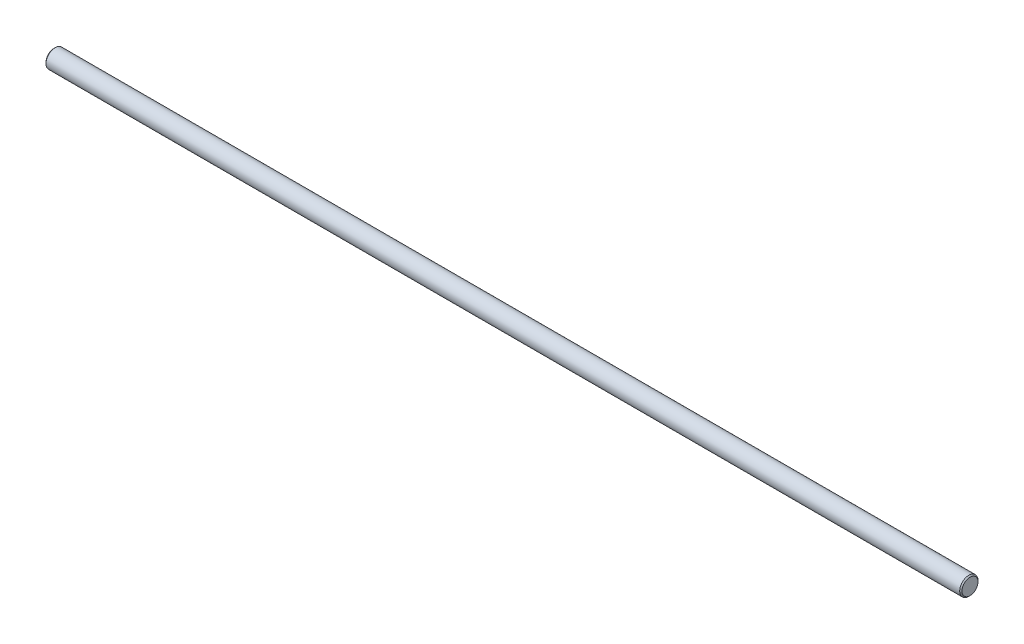
ISO-10303-21;
HEADER;
FILE_DESCRIPTION(('STEP AP214'),'2;1');
FILE_NAME('part.step','',(''),(''),'','','');
FILE_SCHEMA(('AUTOMOTIVE_DESIGN { 1 0 10303 214 1 1 1 1 }'));
ENDSEC;
DATA;
#1=APPLICATION_CONTEXT('core data for automotive mechanical design processes');
#2=APPLICATION_PROTOCOL_DEFINITION('international standard','automotive_design',2000,#1);
#3=PRODUCT_CONTEXT('',#1,'mechanical');
#4=PRODUCT('Part','Part','',(#3));
#5=PRODUCT_RELATED_PRODUCT_CATEGORY('part','',(#4));
#6=PRODUCT_DEFINITION_FORMATION('','',#4);
#7=PRODUCT_DEFINITION_CONTEXT('part definition',#1,'design');
#8=PRODUCT_DEFINITION('design','',#6,#7);
#9=PRODUCT_DEFINITION_SHAPE('','',#8);
#10=(LENGTH_UNIT() NAMED_UNIT(*) SI_UNIT(.MILLI.,.METRE.));
#11=(NAMED_UNIT(*) PLANE_ANGLE_UNIT() SI_UNIT($,.RADIAN.));
#12=(NAMED_UNIT(*) SI_UNIT($,.STERADIAN.) SOLID_ANGLE_UNIT());
#13=UNCERTAINTY_MEASURE_WITH_UNIT(LENGTH_MEASURE(1.E-05),#10,'distance_accuracy_value','');
#14=(GEOMETRIC_REPRESENTATION_CONTEXT(3) GLOBAL_UNCERTAINTY_ASSIGNED_CONTEXT((#13)) GLOBAL_UNIT_ASSIGNED_CONTEXT((#10,
#11,#12)) REPRESENTATION_CONTEXT('',''));
#15=CARTESIAN_POINT('',(0.,0.,0.));
#16=DIRECTION('',(0.,0.,1.));
#17=DIRECTION('',(1.,0.,0.));
#18=AXIS2_PLACEMENT_3D('',#15,#16,#17);
#19=CARTESIAN_POINT('',(400.,0.,0.));
#20=DIRECTION('',(-1.,0.,0.));
#21=DIRECTION('',(0.,0.,1.));
#22=AXIS2_PLACEMENT_3D('',#19,#20,#21);
#23=CYLINDRICAL_SURFACE('',#22,4.);
#24=CARTESIAN_POINT('',(399.5,0.,0.));
#25=DIRECTION('',(1.,0.,0.));
#26=DIRECTION('',(0.,0.,-1.));
#27=AXIS2_PLACEMENT_3D('',#24,#25,#26);
#28=CIRCLE('',#27,4.);
#29=CARTESIAN_POINT('',(399.5,0.,-4.));
#30=VERTEX_POINT('',#29);
#31=EDGE_CURVE('E48',#30,#30,#28,.F.);
#32=ORIENTED_EDGE('',*,*,#31,.T.);
#33=EDGE_LOOP('',(#32));
#34=FACE_BOUND('',#33,.T.);
#35=CARTESIAN_POINT('',(0.500000000000111,0.,0.));
#36=DIRECTION('',(1.,0.,0.));
#37=DIRECTION('',(0.,0.,-1.));
#38=AXIS2_PLACEMENT_3D('',#35,#36,#37);
#39=CIRCLE('',#38,4.);
#40=CARTESIAN_POINT('',(0.500000000000111,0.,-4.));
#41=VERTEX_POINT('',#40);
#42=EDGE_CURVE('E53',#41,#41,#39,.T.);
#43=ORIENTED_EDGE('',*,*,#42,.T.);
#44=EDGE_LOOP('',(#43));
#45=FACE_BOUND('',#44,.T.);
#46=ADVANCED_FACE('F39',(#34,#45),#23,.T.);
#47=CARTESIAN_POINT('',(400.,0.,0.));
#48=DIRECTION('',(1.,0.,0.));
#49=DIRECTION('',(0.,0.,-1.));
#50=AXIS2_PLACEMENT_3D('',#47,#48,#49);
#51=PLANE('',#50);
#52=CARTESIAN_POINT('',(400.,0.,0.));
#53=DIRECTION('',(1.,0.,0.));
#54=DIRECTION('',(0.,0.,-1.));
#55=AXIS2_PLACEMENT_3D('',#52,#53,#54);
#56=CIRCLE('',#55,3.5);
#57=CARTESIAN_POINT('',(400.,0.,-3.5));
#58=VERTEX_POINT('',#57);
#59=EDGE_CURVE('E58',#58,#58,#56,.T.);
#60=ORIENTED_EDGE('',*,*,#59,.T.);
#61=EDGE_LOOP('',(#60));
#62=FACE_BOUND('',#61,.T.);
#63=ADVANCED_FACE('F65',(#62),#51,.T.);
#64=CARTESIAN_POINT('',(0.,0.,0.));
#65=DIRECTION('',(1.,0.,0.));
#66=DIRECTION('',(0.,0.,-1.));
#67=AXIS2_PLACEMENT_3D('',#64,#65,#66);
#68=PLANE('',#67);
#69=CARTESIAN_POINT('',(0.,0.,0.));
#70=DIRECTION('',(1.,0.,0.));
#71=DIRECTION('',(0.,0.,-1.));
#72=AXIS2_PLACEMENT_3D('',#69,#70,#71);
#73=CIRCLE('',#72,3.49999999999989);
#74=CARTESIAN_POINT('',(0.,0.,-3.49999999999989));
#75=VERTEX_POINT('',#74);
#76=EDGE_CURVE('E10',#75,#75,#73,.F.);
#77=ORIENTED_EDGE('',*,*,#76,.T.);
#78=EDGE_LOOP('',(#77));
#79=FACE_BOUND('',#78,.T.);
#80=ADVANCED_FACE('F69',(#79),#68,.F.);
#81=CARTESIAN_POINT('',(400.,0.,0.));
#82=DIRECTION('',(-1.,0.,0.));
#83=DIRECTION('',(0.,0.,1.));
#84=AXIS2_PLACEMENT_3D('',#81,#82,#83);
#85=CONICAL_SURFACE('',#84,3.5,0.785398163397445);
#86=ORIENTED_EDGE('',*,*,#31,.F.);
#87=EDGE_LOOP('',(#86));
#88=FACE_BOUND('',#87,.T.);
#89=ORIENTED_EDGE('',*,*,#59,.F.);
#90=EDGE_LOOP('',(#89));
#91=FACE_BOUND('',#90,.T.);
#92=ADVANCED_FACE('F67',(#88,#91),#85,.T.);
#93=CARTESIAN_POINT('',(0.500000000000111,0.,0.));
#94=DIRECTION('',(1.,0.,0.));
#95=DIRECTION('',(0.,0.,-1.));
#96=AXIS2_PLACEMENT_3D('',#93,#94,#95);
#97=CONICAL_SURFACE('',#96,4.,0.785398163397445);
#98=ORIENTED_EDGE('',*,*,#76,.F.);
#99=EDGE_LOOP('',(#98));
#100=FACE_BOUND('',#99,.T.);
#101=ORIENTED_EDGE('',*,*,#42,.F.);
#102=EDGE_LOOP('',(#101));
#103=FACE_BOUND('',#102,.T.);
#104=ADVANCED_FACE('F42',(#100,#103),#97,.T.);
#105=CLOSED_SHELL('',(#46,#63,#80,#92,#104));
#106=MANIFOLD_SOLID_BREP('B2',#105);
#107=ADVANCED_BREP_SHAPE_REPRESENTATION('',(#18,#106),#14);
#108=SHAPE_DEFINITION_REPRESENTATION(#9,#107);
ENDSEC;
END-ISO-10303-21;
